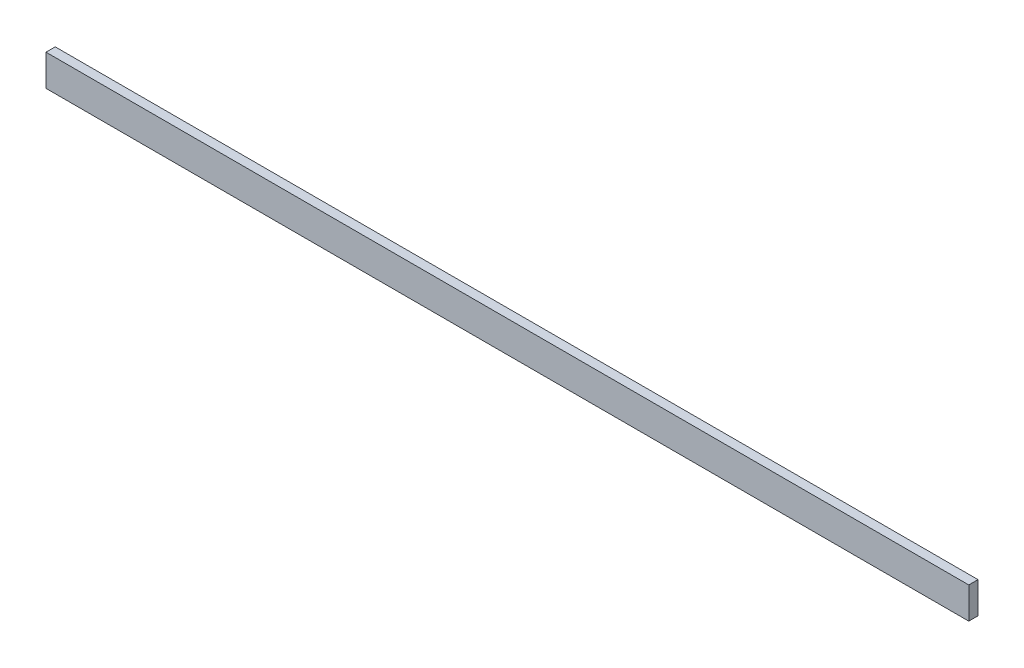
ISO-10303-21;
HEADER;
FILE_DESCRIPTION(('STEP AP214'),'2;1');
FILE_NAME('part.step','',(''),(''),'','','');
FILE_SCHEMA(('AUTOMOTIVE_DESIGN { 1 0 10303 214 1 1 1 1 }'));
ENDSEC;
DATA;
#1=APPLICATION_CONTEXT('core data for automotive mechanical design processes');
#2=APPLICATION_PROTOCOL_DEFINITION('international standard','automotive_design',2000,#1);
#3=PRODUCT_CONTEXT('',#1,'mechanical');
#4=PRODUCT('Part','Part','',(#3));
#5=PRODUCT_RELATED_PRODUCT_CATEGORY('part','',(#4));
#6=PRODUCT_DEFINITION_FORMATION('','',#4);
#7=PRODUCT_DEFINITION_CONTEXT('part definition',#1,'design');
#8=PRODUCT_DEFINITION('design','',#6,#7);
#9=PRODUCT_DEFINITION_SHAPE('','',#8);
#10=(LENGTH_UNIT() NAMED_UNIT(*) SI_UNIT(.MILLI.,.METRE.));
#11=(NAMED_UNIT(*) PLANE_ANGLE_UNIT() SI_UNIT($,.RADIAN.));
#12=(NAMED_UNIT(*) SI_UNIT($,.STERADIAN.) SOLID_ANGLE_UNIT());
#13=UNCERTAINTY_MEASURE_WITH_UNIT(LENGTH_MEASURE(1.E-05),#10,'distance_accuracy_value','');
#14=(GEOMETRIC_REPRESENTATION_CONTEXT(3) GLOBAL_UNCERTAINTY_ASSIGNED_CONTEXT((#13)) GLOBAL_UNIT_ASSIGNED_CONTEXT((#10,
#11,#12)) REPRESENTATION_CONTEXT('',''));
#15=CARTESIAN_POINT('',(0.,0.,0.));
#16=DIRECTION('',(0.,0.,1.));
#17=DIRECTION('',(1.,0.,0.));
#18=AXIS2_PLACEMENT_3D('',#15,#16,#17);
#19=CARTESIAN_POINT('',(250.,8.49999999999998,-5.));
#20=DIRECTION('',(1.,0.,0.));
#21=DIRECTION('',(0.,0.,-1.));
#22=AXIS2_PLACEMENT_3D('',#19,#20,#21);
#23=PLANE('',#22);
#24=DIRECTION('',(0.,1.,0.));
#25=VECTOR('',#24,1.);
#26=CARTESIAN_POINT('',(250.,8.49999999999998,0.));
#27=LINE('',#26,#25);
#28=CARTESIAN_POINT('',(250.,-8.50000000000004,0.));
#29=VERTEX_POINT('',#28);
#30=CARTESIAN_POINT('',(250.,8.49999999999998,0.));
#31=VERTEX_POINT('',#30);
#32=EDGE_CURVE('E103',#29,#31,#27,.T.);
#33=ORIENTED_EDGE('',*,*,#32,.F.);
#34=DIRECTION('',(0.,0.,1.));
#35=VECTOR('',#34,1.);
#36=CARTESIAN_POINT('',(250.,-8.50000000000004,-5.));
#37=LINE('',#36,#35);
#38=CARTESIAN_POINT('',(250.,-8.50000000000004,-5.));
#39=VERTEX_POINT('',#38);
#40=EDGE_CURVE('E11',#39,#29,#37,.T.);
#41=ORIENTED_EDGE('',*,*,#40,.F.);
#42=DIRECTION('',(0.,1.,0.));
#43=VECTOR('',#42,1.);
#44=CARTESIAN_POINT('',(250.,8.49999999999998,-5.));
#45=LINE('',#44,#43);
#46=CARTESIAN_POINT('',(250.,8.49999999999998,-5.));
#47=VERTEX_POINT('',#46);
#48=EDGE_CURVE('E97',#39,#47,#45,.T.);
#49=ORIENTED_EDGE('',*,*,#48,.T.);
#50=DIRECTION('',(0.,0.,1.));
#51=VECTOR('',#50,1.);
#52=CARTESIAN_POINT('',(250.,8.49999999999998,-5.));
#53=LINE('',#52,#51);
#54=EDGE_CURVE('E42',#47,#31,#53,.T.);
#55=ORIENTED_EDGE('',*,*,#54,.T.);
#56=EDGE_LOOP('',(#33,#41,#49,#55));
#57=FACE_BOUND('',#56,.T.);
#58=ADVANCED_FACE('F39',(#57),#23,.T.);
#59=CARTESIAN_POINT('',(-250.,-8.50000000000004,-5.));
#60=DIRECTION('',(0.,-1.,0.));
#61=DIRECTION('',(0.,0.,-1.));
#62=AXIS2_PLACEMENT_3D('',#59,#60,#61);
#63=PLANE('',#62);
#64=DIRECTION('',(1.,0.,0.));
#65=VECTOR('',#64,1.);
#66=CARTESIAN_POINT('',(-250.,-8.50000000000004,0.));
#67=LINE('',#66,#65);
#68=CARTESIAN_POINT('',(-250.,-8.50000000000004,0.));
#69=VERTEX_POINT('',#68);
#70=EDGE_CURVE('E99',#69,#29,#67,.T.);
#71=ORIENTED_EDGE('',*,*,#70,.F.);
#72=DIRECTION('',(0.,0.,1.));
#73=VECTOR('',#72,1.);
#74=CARTESIAN_POINT('',(-250.,-8.50000000000004,-5.));
#75=LINE('',#74,#73);
#76=CARTESIAN_POINT('',(-250.,-8.50000000000004,-5.));
#77=VERTEX_POINT('',#76);
#78=EDGE_CURVE('E48',#77,#69,#75,.T.);
#79=ORIENTED_EDGE('',*,*,#78,.F.);
#80=DIRECTION('',(1.,0.,0.));
#81=VECTOR('',#80,1.);
#82=CARTESIAN_POINT('',(-250.,-8.50000000000004,-5.));
#83=LINE('',#82,#81);
#84=EDGE_CURVE('E94',#77,#39,#83,.T.);
#85=ORIENTED_EDGE('',*,*,#84,.T.);
#86=ORIENTED_EDGE('',*,*,#40,.T.);
#87=EDGE_LOOP('',(#71,#79,#85,#86));
#88=FACE_BOUND('',#87,.T.);
#89=ADVANCED_FACE('F113',(#88),#63,.T.);
#90=CARTESIAN_POINT('',(-250.,8.49999999999998,-5.));
#91=DIRECTION('',(-1.,0.,0.));
#92=DIRECTION('',(0.,0.,1.));
#93=AXIS2_PLACEMENT_3D('',#90,#91,#92);
#94=PLANE('',#93);
#95=DIRECTION('',(0.,-1.,0.));
#96=VECTOR('',#95,1.);
#97=CARTESIAN_POINT('',(-250.,8.49999999999998,0.));
#98=LINE('',#97,#96);
#99=CARTESIAN_POINT('',(-250.,8.49999999999998,0.));
#100=VERTEX_POINT('',#99);
#101=EDGE_CURVE('E89',#100,#69,#98,.T.);
#102=ORIENTED_EDGE('',*,*,#101,.F.);
#103=DIRECTION('',(0.,0.,1.));
#104=VECTOR('',#103,1.);
#105=CARTESIAN_POINT('',(-250.,8.49999999999998,-5.));
#106=LINE('',#105,#104);
#107=CARTESIAN_POINT('',(-250.,8.49999999999998,-5.));
#108=VERTEX_POINT('',#107);
#109=EDGE_CURVE('E84',#108,#100,#106,.T.);
#110=ORIENTED_EDGE('',*,*,#109,.F.);
#111=DIRECTION('',(0.,-1.,0.));
#112=VECTOR('',#111,1.);
#113=CARTESIAN_POINT('',(-250.,8.49999999999998,-5.));
#114=LINE('',#113,#112);
#115=EDGE_CURVE('E87',#108,#77,#114,.T.);
#116=ORIENTED_EDGE('',*,*,#115,.T.);
#117=ORIENTED_EDGE('',*,*,#78,.T.);
#118=EDGE_LOOP('',(#102,#110,#116,#117));
#119=FACE_BOUND('',#118,.T.);
#120=ADVANCED_FACE('F86',(#119),#94,.T.);
#121=CARTESIAN_POINT('',(-250.,8.49999999999998,-5.));
#122=DIRECTION('',(0.,1.,0.));
#123=DIRECTION('',(0.,0.,1.));
#124=AXIS2_PLACEMENT_3D('',#121,#122,#123);
#125=PLANE('',#124);
#126=DIRECTION('',(-1.,0.,0.));
#127=VECTOR('',#126,1.);
#128=CARTESIAN_POINT('',(-250.,8.49999999999998,0.));
#129=LINE('',#128,#127);
#130=EDGE_CURVE('E106',#31,#100,#129,.T.);
#131=ORIENTED_EDGE('',*,*,#130,.F.);
#132=ORIENTED_EDGE('',*,*,#54,.F.);
#133=DIRECTION('',(-1.,0.,0.));
#134=VECTOR('',#133,1.);
#135=CARTESIAN_POINT('',(-250.,8.49999999999998,-5.));
#136=LINE('',#135,#134);
#137=EDGE_CURVE('E93',#47,#108,#136,.T.);
#138=ORIENTED_EDGE('',*,*,#137,.T.);
#139=ORIENTED_EDGE('',*,*,#109,.T.);
#140=EDGE_LOOP('',(#131,#132,#138,#139));
#141=FACE_BOUND('',#140,.T.);
#142=ADVANCED_FACE('F96',(#141),#125,.T.);
#143=CARTESIAN_POINT('',(0.,0.,-5.));
#144=DIRECTION('',(0.,0.,1.));
#145=DIRECTION('',(1.,0.,0.));
#146=AXIS2_PLACEMENT_3D('',#143,#144,#145);
#147=PLANE('',#146);
#148=ORIENTED_EDGE('',*,*,#48,.F.);
#149=ORIENTED_EDGE('',*,*,#84,.F.);
#150=ORIENTED_EDGE('',*,*,#115,.F.);
#151=ORIENTED_EDGE('',*,*,#137,.F.);
#152=EDGE_LOOP('',(#148,#149,#150,#151));
#153=FACE_BOUND('',#152,.T.);
#154=ADVANCED_FACE('F92',(#153),#147,.F.);
#155=CARTESIAN_POINT('',(0.,0.,0.));
#156=DIRECTION('',(0.,0.,1.));
#157=DIRECTION('',(1.,0.,0.));
#158=AXIS2_PLACEMENT_3D('',#155,#156,#157);
#159=PLANE('',#158);
#160=ORIENTED_EDGE('',*,*,#32,.T.);
#161=ORIENTED_EDGE('',*,*,#130,.T.);
#162=ORIENTED_EDGE('',*,*,#101,.T.);
#163=ORIENTED_EDGE('',*,*,#70,.T.);
#164=EDGE_LOOP('',(#160,#161,#162,#163));
#165=FACE_BOUND('',#164,.T.);
#166=ADVANCED_FACE('F112',(#165),#159,.T.);
#167=CLOSED_SHELL('',(#58,#89,#120,#142,#154,#166));
#168=MANIFOLD_SOLID_BREP('B2',#167);
#169=ADVANCED_BREP_SHAPE_REPRESENTATION('',(#18,#168),#14);
#170=SHAPE_DEFINITION_REPRESENTATION(#9,#169);
ENDSEC;
END-ISO-10303-21;
